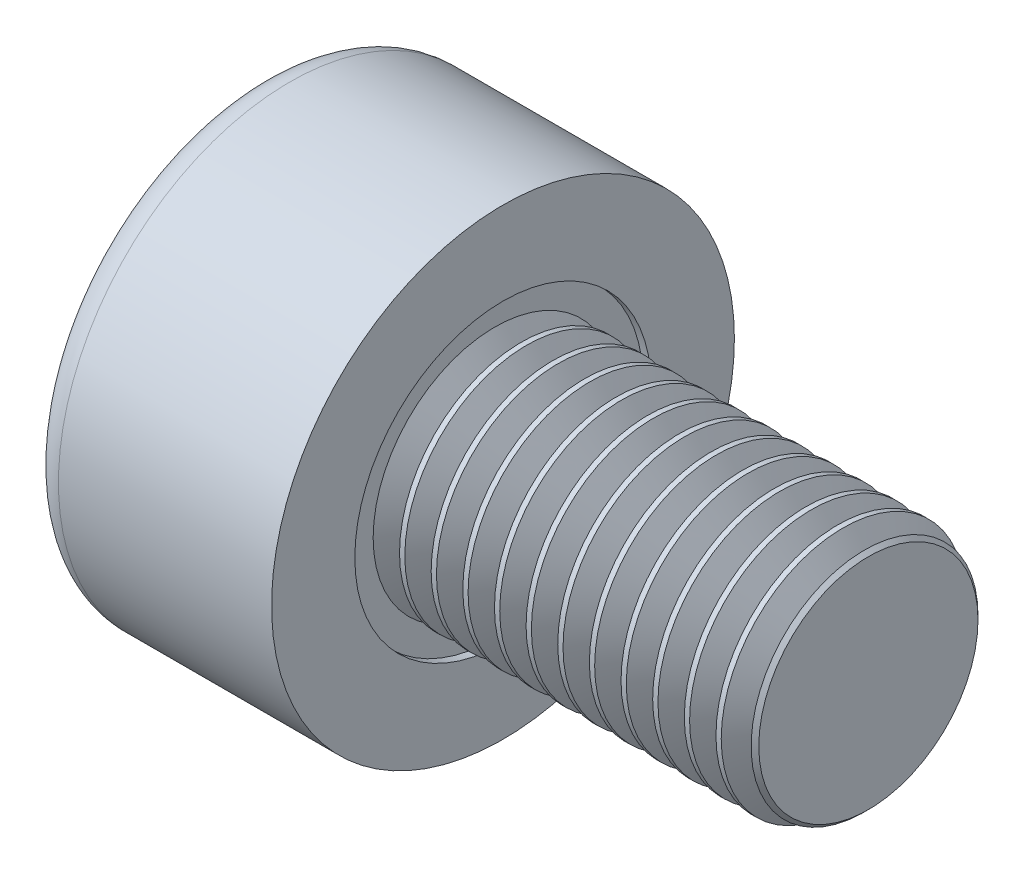
ISO-10303-21;
HEADER;
FILE_DESCRIPTION(('STEP AP214'),'2;1');
FILE_NAME('part.step','',(''),(''),'','','');
FILE_SCHEMA(('AUTOMOTIVE_DESIGN { 1 0 10303 214 1 1 1 1 }'));
ENDSEC;
DATA;
#1=APPLICATION_CONTEXT('core data for automotive mechanical design processes');
#2=APPLICATION_PROTOCOL_DEFINITION('international standard','automotive_design',2000,#1);
#3=PRODUCT_CONTEXT('',#1,'mechanical');
#4=PRODUCT('Part','Part','',(#3));
#5=PRODUCT_RELATED_PRODUCT_CATEGORY('part','',(#4));
#6=PRODUCT_DEFINITION_FORMATION('','',#4);
#7=PRODUCT_DEFINITION_CONTEXT('part definition',#1,'design');
#8=PRODUCT_DEFINITION('design','',#6,#7);
#9=PRODUCT_DEFINITION_SHAPE('','',#8);
#10=(LENGTH_UNIT() NAMED_UNIT(*) SI_UNIT(.MILLI.,.METRE.));
#11=(NAMED_UNIT(*) PLANE_ANGLE_UNIT() SI_UNIT($,.RADIAN.));
#12=(NAMED_UNIT(*) SI_UNIT($,.STERADIAN.) SOLID_ANGLE_UNIT());
#13=UNCERTAINTY_MEASURE_WITH_UNIT(LENGTH_MEASURE(1.E-05),#10,'distance_accuracy_value','');
#14=(GEOMETRIC_REPRESENTATION_CONTEXT(3) GLOBAL_UNCERTAINTY_ASSIGNED_CONTEXT((#13)) GLOBAL_UNIT_ASSIGNED_CONTEXT((#10,
#11,#12)) REPRESENTATION_CONTEXT('',''));
#15=CARTESIAN_POINT('',(0.,0.,0.));
#16=DIRECTION('',(0.,0.,1.));
#17=DIRECTION('',(1.,0.,0.));
#18=AXIS2_PLACEMENT_3D('',#15,#16,#17);
#19=CARTESIAN_POINT('',(5.,0.,0.));
#20=DIRECTION('',(-1.,0.,0.));
#21=DIRECTION('',(0.,0.,1.));
#22=AXIS2_PLACEMENT_3D('',#19,#20,#21);
#23=CYLINDRICAL_SURFACE('',#22,1.);
#24=CARTESIAN_POINT('',(2.19375,0.,0.));
#25=DIRECTION('',(-1.,0.,0.));
#26=DIRECTION('',(0.,0.,1.));
#27=AXIS2_PLACEMENT_3D('',#24,#25,#26);
#28=CIRCLE('',#27,1.);
#29=CARTESIAN_POINT('',(2.19375,0.,1.));
#30=VERTEX_POINT('',#29);
#31=EDGE_CURVE('E298',#30,#30,#28,.T.);
#32=ORIENTED_EDGE('',*,*,#31,.T.);
#33=EDGE_LOOP('',(#32));
#34=FACE_BOUND('',#33,.T.);
#35=CARTESIAN_POINT('',(2.15045,0.,0.));
#36=DIRECTION('',(-1.,0.,0.));
#37=DIRECTION('',(0.,0.,1.));
#38=AXIS2_PLACEMENT_3D('',#35,#36,#37);
#39=CIRCLE('',#38,1.);
#40=CARTESIAN_POINT('',(2.15045,0.,1.));
#41=VERTEX_POINT('',#40);
#42=EDGE_CURVE('E313',#41,#41,#39,.T.);
#43=ORIENTED_EDGE('',*,*,#42,.F.);
#44=EDGE_LOOP('',(#43));
#45=FACE_BOUND('',#44,.T.);
#46=ADVANCED_FACE('F38',(#34,#45),#23,.T.);
#47=CARTESIAN_POINT('',(2.45355,0.,0.));
#48=DIRECTION('',(-1.,0.,0.));
#49=DIRECTION('',(0.,0.,1.));
#50=AXIS2_PLACEMENT_3D('',#47,#48,#49);
#51=CIRCLE('',#50,1.);
#52=CARTESIAN_POINT('',(2.45355,0.,1.));
#53=VERTEX_POINT('',#52);
#54=EDGE_CURVE('E289',#53,#53,#51,.T.);
#55=ORIENTED_EDGE('',*,*,#54,.T.);
#56=EDGE_LOOP('',(#55));
#57=FACE_BOUND('',#56,.T.);
#58=CARTESIAN_POINT('',(2.41025,0.,0.));
#59=DIRECTION('',(-1.,0.,0.));
#60=DIRECTION('',(0.,0.,1.));
#61=AXIS2_PLACEMENT_3D('',#58,#59,#60);
#62=CIRCLE('',#61,1.);
#63=CARTESIAN_POINT('',(2.41025,0.,1.));
#64=VERTEX_POINT('',#63);
#65=EDGE_CURVE('E301',#64,#64,#62,.T.);
#66=ORIENTED_EDGE('',*,*,#65,.F.);
#67=EDGE_LOOP('',(#66));
#68=FACE_BOUND('',#67,.T.);
#69=ADVANCED_FACE('F334',(#57,#68),#23,.T.);
#70=CARTESIAN_POINT('',(2.71335,0.,0.));
#71=DIRECTION('',(-1.,0.,0.));
#72=DIRECTION('',(0.,0.,1.));
#73=AXIS2_PLACEMENT_3D('',#70,#71,#72);
#74=CIRCLE('',#73,1.);
#75=CARTESIAN_POINT('',(2.71335,0.,1.));
#76=VERTEX_POINT('',#75);
#77=EDGE_CURVE('E280',#76,#76,#74,.T.);
#78=ORIENTED_EDGE('',*,*,#77,.T.);
#79=EDGE_LOOP('',(#78));
#80=FACE_BOUND('',#79,.T.);
#81=CARTESIAN_POINT('',(2.67005,0.,0.));
#82=DIRECTION('',(-1.,0.,0.));
#83=DIRECTION('',(0.,0.,1.));
#84=AXIS2_PLACEMENT_3D('',#81,#82,#83);
#85=CIRCLE('',#84,1.);
#86=CARTESIAN_POINT('',(2.67005,0.,1.));
#87=VERTEX_POINT('',#86);
#88=EDGE_CURVE('E292',#87,#87,#85,.T.);
#89=ORIENTED_EDGE('',*,*,#88,.F.);
#90=EDGE_LOOP('',(#89));
#91=FACE_BOUND('',#90,.T.);
#92=ADVANCED_FACE('F341',(#80,#91),#23,.T.);
#93=CARTESIAN_POINT('',(2.97315,0.,0.));
#94=DIRECTION('',(-1.,0.,0.));
#95=DIRECTION('',(0.,0.,1.));
#96=AXIS2_PLACEMENT_3D('',#93,#94,#95);
#97=CIRCLE('',#96,1.);
#98=CARTESIAN_POINT('',(2.97315,0.,1.));
#99=VERTEX_POINT('',#98);
#100=EDGE_CURVE('E271',#99,#99,#97,.T.);
#101=ORIENTED_EDGE('',*,*,#100,.T.);
#102=EDGE_LOOP('',(#101));
#103=FACE_BOUND('',#102,.T.);
#104=CARTESIAN_POINT('',(2.92985,0.,0.));
#105=DIRECTION('',(-1.,0.,0.));
#106=DIRECTION('',(0.,0.,1.));
#107=AXIS2_PLACEMENT_3D('',#104,#105,#106);
#108=CIRCLE('',#107,1.);
#109=CARTESIAN_POINT('',(2.92985,0.,1.));
#110=VERTEX_POINT('',#109);
#111=EDGE_CURVE('E283',#110,#110,#108,.T.);
#112=ORIENTED_EDGE('',*,*,#111,.F.);
#113=EDGE_LOOP('',(#112));
#114=FACE_BOUND('',#113,.T.);
#115=ADVANCED_FACE('F450',(#103,#114),#23,.T.);
#116=CARTESIAN_POINT('',(3.23295,0.,0.));
#117=DIRECTION('',(-1.,0.,0.));
#118=DIRECTION('',(0.,0.,1.));
#119=AXIS2_PLACEMENT_3D('',#116,#117,#118);
#120=CIRCLE('',#119,1.);
#121=CARTESIAN_POINT('',(3.23295,0.,1.));
#122=VERTEX_POINT('',#121);
#123=EDGE_CURVE('E262',#122,#122,#120,.T.);
#124=ORIENTED_EDGE('',*,*,#123,.T.);
#125=EDGE_LOOP('',(#124));
#126=FACE_BOUND('',#125,.T.);
#127=CARTESIAN_POINT('',(3.18965,0.,0.));
#128=DIRECTION('',(-1.,0.,0.));
#129=DIRECTION('',(0.,0.,1.));
#130=AXIS2_PLACEMENT_3D('',#127,#128,#129);
#131=CIRCLE('',#130,1.);
#132=CARTESIAN_POINT('',(3.18965,0.,1.));
#133=VERTEX_POINT('',#132);
#134=EDGE_CURVE('E274',#133,#133,#131,.T.);
#135=ORIENTED_EDGE('',*,*,#134,.F.);
#136=EDGE_LOOP('',(#135));
#137=FACE_BOUND('',#136,.T.);
#138=ADVANCED_FACE('F433',(#126,#137),#23,.T.);
#139=CARTESIAN_POINT('',(3.49275,0.,0.));
#140=DIRECTION('',(-1.,0.,0.));
#141=DIRECTION('',(0.,0.,1.));
#142=AXIS2_PLACEMENT_3D('',#139,#140,#141);
#143=CIRCLE('',#142,1.);
#144=CARTESIAN_POINT('',(3.49275,0.,1.));
#145=VERTEX_POINT('',#144);
#146=EDGE_CURVE('E253',#145,#145,#143,.T.);
#147=ORIENTED_EDGE('',*,*,#146,.T.);
#148=EDGE_LOOP('',(#147));
#149=FACE_BOUND('',#148,.T.);
#150=CARTESIAN_POINT('',(3.44945,0.,0.));
#151=DIRECTION('',(-1.,0.,0.));
#152=DIRECTION('',(0.,0.,1.));
#153=AXIS2_PLACEMENT_3D('',#150,#151,#152);
#154=CIRCLE('',#153,1.);
#155=CARTESIAN_POINT('',(3.44945,0.,1.));
#156=VERTEX_POINT('',#155);
#157=EDGE_CURVE('E265',#156,#156,#154,.T.);
#158=ORIENTED_EDGE('',*,*,#157,.F.);
#159=EDGE_LOOP('',(#158));
#160=FACE_BOUND('',#159,.T.);
#161=ADVANCED_FACE('F416',(#149,#160),#23,.T.);
#162=CARTESIAN_POINT('',(3.75255,0.,0.));
#163=DIRECTION('',(-1.,0.,0.));
#164=DIRECTION('',(0.,0.,1.));
#165=AXIS2_PLACEMENT_3D('',#162,#163,#164);
#166=CIRCLE('',#165,1.);
#167=CARTESIAN_POINT('',(3.75255,0.,1.));
#168=VERTEX_POINT('',#167);
#169=EDGE_CURVE('E244',#168,#168,#166,.T.);
#170=ORIENTED_EDGE('',*,*,#169,.T.);
#171=EDGE_LOOP('',(#170));
#172=FACE_BOUND('',#171,.T.);
#173=CARTESIAN_POINT('',(3.70925,0.,0.));
#174=DIRECTION('',(-1.,0.,0.));
#175=DIRECTION('',(0.,0.,1.));
#176=AXIS2_PLACEMENT_3D('',#173,#174,#175);
#177=CIRCLE('',#176,1.);
#178=CARTESIAN_POINT('',(3.70925,0.,1.));
#179=VERTEX_POINT('',#178);
#180=EDGE_CURVE('E256',#179,#179,#177,.T.);
#181=ORIENTED_EDGE('',*,*,#180,.F.);
#182=EDGE_LOOP('',(#181));
#183=FACE_BOUND('',#182,.T.);
#184=ADVANCED_FACE('F386',(#172,#183),#23,.T.);
#185=CARTESIAN_POINT('',(4.01235,0.,0.));
#186=DIRECTION('',(-1.,0.,0.));
#187=DIRECTION('',(0.,0.,1.));
#188=AXIS2_PLACEMENT_3D('',#185,#186,#187);
#189=CIRCLE('',#188,1.);
#190=CARTESIAN_POINT('',(4.01235,0.,1.));
#191=VERTEX_POINT('',#190);
#192=EDGE_CURVE('E235',#191,#191,#189,.T.);
#193=ORIENTED_EDGE('',*,*,#192,.T.);
#194=EDGE_LOOP('',(#193));
#195=FACE_BOUND('',#194,.T.);
#196=CARTESIAN_POINT('',(3.96905,0.,0.));
#197=DIRECTION('',(-1.,0.,0.));
#198=DIRECTION('',(0.,0.,1.));
#199=AXIS2_PLACEMENT_3D('',#196,#197,#198);
#200=CIRCLE('',#199,1.);
#201=CARTESIAN_POINT('',(3.96905,0.,1.));
#202=VERTEX_POINT('',#201);
#203=EDGE_CURVE('E247',#202,#202,#200,.T.);
#204=ORIENTED_EDGE('',*,*,#203,.F.);
#205=EDGE_LOOP('',(#204));
#206=FACE_BOUND('',#205,.T.);
#207=ADVANCED_FACE('F377',(#195,#206),#23,.T.);
#208=CARTESIAN_POINT('',(4.27215,0.,0.));
#209=DIRECTION('',(-1.,0.,0.));
#210=DIRECTION('',(0.,0.,1.));
#211=AXIS2_PLACEMENT_3D('',#208,#209,#210);
#212=CIRCLE('',#211,1.);
#213=CARTESIAN_POINT('',(4.27215,0.,1.));
#214=VERTEX_POINT('',#213);
#215=EDGE_CURVE('E226',#214,#214,#212,.T.);
#216=ORIENTED_EDGE('',*,*,#215,.T.);
#217=EDGE_LOOP('',(#216));
#218=FACE_BOUND('',#217,.T.);
#219=CARTESIAN_POINT('',(4.22885,0.,0.));
#220=DIRECTION('',(-1.,0.,0.));
#221=DIRECTION('',(0.,0.,1.));
#222=AXIS2_PLACEMENT_3D('',#219,#220,#221);
#223=CIRCLE('',#222,1.);
#224=CARTESIAN_POINT('',(4.22885,0.,1.));
#225=VERTEX_POINT('',#224);
#226=EDGE_CURVE('E238',#225,#225,#223,.T.);
#227=ORIENTED_EDGE('',*,*,#226,.F.);
#228=EDGE_LOOP('',(#227));
#229=FACE_BOUND('',#228,.T.);
#230=ADVANCED_FACE('F364',(#218,#229),#23,.T.);
#231=CARTESIAN_POINT('',(4.27215,0.,0.));
#232=DIRECTION('',(-1.,0.,0.));
#233=DIRECTION('',(0.,0.,1.));
#234=AXIS2_PLACEMENT_3D('',#231,#232,#233);
#235=CONICAL_SURFACE('',#234,1.,1.04719755119661);
#236=CARTESIAN_POINT('',(4.3804,0.,0.));
#237=DIRECTION('',(-1.,0.,0.));
#238=DIRECTION('',(0.,0.,1.));
#239=AXIS2_PLACEMENT_3D('',#236,#237,#238);
#240=CIRCLE('',#239,0.812505500080668);
#241=CARTESIAN_POINT('',(4.3804,0.,0.812505500080668));
#242=VERTEX_POINT('',#241);
#243=EDGE_CURVE('E232',#242,#242,#240,.T.);
#244=ORIENTED_EDGE('',*,*,#243,.T.);
#245=EDGE_LOOP('',(#244));
#246=FACE_BOUND('',#245,.T.);
#247=ORIENTED_EDGE('',*,*,#215,.F.);
#248=EDGE_LOOP('',(#247));
#249=FACE_BOUND('',#248,.T.);
#250=ADVANCED_FACE('F376',(#246,#249),#235,.T.);
#251=CARTESIAN_POINT('',(4.3804,0.,0.));
#252=DIRECTION('',(1.,0.,0.));
#253=DIRECTION('',(0.,0.,-1.));
#254=AXIS2_PLACEMENT_3D('',#251,#252,#253);
#255=CONICAL_SURFACE('',#254,0.812505500080668,1.04719755119658);
#256=CARTESIAN_POINT('',(4.48865,0.,0.));
#257=DIRECTION('',(-1.,0.,0.));
#258=DIRECTION('',(0.,0.,1.));
#259=AXIS2_PLACEMENT_3D('',#256,#257,#258);
#260=CIRCLE('',#259,1.);
#261=CARTESIAN_POINT('',(4.48865,0.,1.));
#262=VERTEX_POINT('',#261);
#263=EDGE_CURVE('E229',#262,#262,#260,.T.);
#264=ORIENTED_EDGE('',*,*,#263,.T.);
#265=EDGE_LOOP('',(#264));
#266=FACE_BOUND('',#265,.T.);
#267=ORIENTED_EDGE('',*,*,#243,.F.);
#268=EDGE_LOOP('',(#267));
#269=FACE_BOUND('',#268,.T.);
#270=ADVANCED_FACE('F383',(#266,#269),#255,.T.);
#271=CARTESIAN_POINT('',(5.,0.,0.));
#272=DIRECTION('',(1.,0.,0.));
#273=DIRECTION('',(0.,0.,-1.));
#274=AXIS2_PLACEMENT_3D('',#271,#272,#273);
#275=PLANE('',#274);
#276=CARTESIAN_POINT('',(5.,0.,0.));
#277=DIRECTION('',(1.,0.,0.));
#278=DIRECTION('',(0.,0.,-1.));
#279=AXIS2_PLACEMENT_3D('',#276,#277,#278);
#280=CIRCLE('',#279,0.899999999999999);
#281=CARTESIAN_POINT('',(5.,0.,-0.899999999999999));
#282=VERTEX_POINT('',#281);
#283=EDGE_CURVE('E12',#282,#282,#280,.T.);
#284=ORIENTED_EDGE('',*,*,#283,.T.);
#285=EDGE_LOOP('',(#284));
#286=FACE_BOUND('',#285,.T.);
#287=ADVANCED_FACE('F514',(#286),#275,.T.);
#288=CARTESIAN_POINT('',(5.,0.,0.));
#289=DIRECTION('',(-1.,0.,0.));
#290=DIRECTION('',(0.,0.,1.));
#291=AXIS2_PLACEMENT_3D('',#288,#289,#290);
#292=CONICAL_SURFACE('',#291,0.899999999999999,0.785398163397444);
#293=ORIENTED_EDGE('',*,*,#283,.F.);
#294=EDGE_LOOP('',(#293));
#295=FACE_BOUND('',#294,.T.);
#296=CARTESIAN_POINT('',(4.96862775004033,0.,0.));
#297=DIRECTION('',(1.,0.,0.));
#298=DIRECTION('',(0.,0.,-1.));
#299=AXIS2_PLACEMENT_3D('',#296,#297,#298);
#300=CIRCLE('',#299,0.931372249959664);
#301=CARTESIAN_POINT('',(4.96862775004033,0.,-0.931372249959664));
#302=VERTEX_POINT('',#301);
#303=EDGE_CURVE('E130',#302,#302,#300,.T.);
#304=ORIENTED_EDGE('',*,*,#303,.T.);
#305=EDGE_LOOP('',(#304));
#306=FACE_BOUND('',#305,.T.);
#307=ADVANCED_FACE('F40',(#295,#306),#292,.T.);
#308=CARTESIAN_POINT('',(4.9,0.,0.));
#309=DIRECTION('',(1.,0.,0.));
#310=DIRECTION('',(0.,0.,-1.));
#311=AXIS2_PLACEMENT_3D('',#308,#309,#310);
#312=CONICAL_SURFACE('',#311,0.812505500080668,1.04719755119658);
#313=ORIENTED_EDGE('',*,*,#303,.F.);
#314=EDGE_LOOP('',(#313));
#315=FACE_BOUND('',#314,.T.);
#316=CARTESIAN_POINT('',(4.9,0.,0.));
#317=DIRECTION('',(-1.,0.,0.));
#318=DIRECTION('',(0.,0.,1.));
#319=AXIS2_PLACEMENT_3D('',#316,#317,#318);
#320=CIRCLE('',#319,0.812505500080668);
#321=CARTESIAN_POINT('',(4.9,0.,0.812505500080668));
#322=VERTEX_POINT('',#321);
#323=EDGE_CURVE('E210',#322,#322,#320,.T.);
#324=ORIENTED_EDGE('',*,*,#323,.F.);
#325=EDGE_LOOP('',(#324));
#326=FACE_BOUND('',#325,.T.);
#327=ADVANCED_FACE('F357',(#315,#326),#312,.T.);
#328=CARTESIAN_POINT('',(4.79175,0.,0.));
#329=DIRECTION('',(-1.,0.,0.));
#330=DIRECTION('',(0.,0.,1.));
#331=AXIS2_PLACEMENT_3D('',#328,#329,#330);
#332=CONICAL_SURFACE('',#331,1.,1.04719755119661);
#333=ORIENTED_EDGE('',*,*,#323,.T.);
#334=EDGE_LOOP('',(#333));
#335=FACE_BOUND('',#334,.T.);
#336=CARTESIAN_POINT('',(4.79175,0.,0.));
#337=DIRECTION('',(-1.,0.,0.));
#338=DIRECTION('',(0.,0.,1.));
#339=AXIS2_PLACEMENT_3D('',#336,#337,#338);
#340=CIRCLE('',#339,1.);
#341=CARTESIAN_POINT('',(4.79175,0.,1.));
#342=VERTEX_POINT('',#341);
#343=EDGE_CURVE('E206',#342,#342,#340,.T.);
#344=ORIENTED_EDGE('',*,*,#343,.F.);
#345=EDGE_LOOP('',(#344));
#346=FACE_BOUND('',#345,.T.);
#347=ADVANCED_FACE('F348',(#335,#346),#332,.T.);
#348=ORIENTED_EDGE('',*,*,#343,.T.);
#349=EDGE_LOOP('',(#348));
#350=FACE_BOUND('',#349,.T.);
#351=CARTESIAN_POINT('',(4.74845,0.,0.));
#352=DIRECTION('',(-1.,0.,0.));
#353=DIRECTION('',(0.,0.,1.));
#354=AXIS2_PLACEMENT_3D('',#351,#352,#353);
#355=CIRCLE('',#354,1.);
#356=CARTESIAN_POINT('',(4.74845,0.,1.));
#357=VERTEX_POINT('',#356);
#358=EDGE_CURVE('E220',#357,#357,#355,.T.);
#359=ORIENTED_EDGE('',*,*,#358,.F.);
#360=EDGE_LOOP('',(#359));
#361=FACE_BOUND('',#360,.T.);
#362=ADVANCED_FACE('F337',(#350,#361),#23,.T.);
#363=CARTESIAN_POINT('',(4.6402,0.,0.));
#364=DIRECTION('',(1.,0.,0.));
#365=DIRECTION('',(0.,0.,-1.));
#366=AXIS2_PLACEMENT_3D('',#363,#364,#365);
#367=CONICAL_SURFACE('',#366,0.812505500080668,1.04719755119658);
#368=ORIENTED_EDGE('',*,*,#358,.T.);
#369=EDGE_LOOP('',(#368));
#370=FACE_BOUND('',#369,.T.);
#371=CARTESIAN_POINT('',(4.6402,0.,0.));
#372=DIRECTION('',(-1.,0.,0.));
#373=DIRECTION('',(0.,0.,1.));
#374=AXIS2_PLACEMENT_3D('',#371,#372,#373);
#375=CIRCLE('',#374,0.812505500080668);
#376=CARTESIAN_POINT('',(4.6402,0.,0.812505500080668));
#377=VERTEX_POINT('',#376);
#378=EDGE_CURVE('E223',#377,#377,#375,.T.);
#379=ORIENTED_EDGE('',*,*,#378,.F.);
#380=EDGE_LOOP('',(#379));
#381=FACE_BOUND('',#380,.T.);
#382=ADVANCED_FACE('F347',(#370,#381),#367,.T.);
#383=CARTESIAN_POINT('',(4.53195,0.,0.));
#384=DIRECTION('',(-1.,0.,0.));
#385=DIRECTION('',(0.,0.,1.));
#386=AXIS2_PLACEMENT_3D('',#383,#384,#385);
#387=CONICAL_SURFACE('',#386,1.,1.04719755119661);
#388=ORIENTED_EDGE('',*,*,#378,.T.);
#389=EDGE_LOOP('',(#388));
#390=FACE_BOUND('',#389,.T.);
#391=CARTESIAN_POINT('',(4.53195,0.,0.));
#392=DIRECTION('',(-1.,0.,0.));
#393=DIRECTION('',(0.,0.,1.));
#394=AXIS2_PLACEMENT_3D('',#391,#392,#393);
#395=CIRCLE('',#394,1.);
#396=CARTESIAN_POINT('',(4.53195,0.,1.));
#397=VERTEX_POINT('',#396);
#398=EDGE_CURVE('E215',#397,#397,#395,.T.);
#399=ORIENTED_EDGE('',*,*,#398,.F.);
#400=EDGE_LOOP('',(#399));
#401=FACE_BOUND('',#400,.T.);
#402=ADVANCED_FACE('F354',(#390,#401),#387,.T.);
#403=ORIENTED_EDGE('',*,*,#398,.T.);
#404=EDGE_LOOP('',(#403));
#405=FACE_BOUND('',#404,.T.);
#406=ORIENTED_EDGE('',*,*,#263,.F.);
#407=EDGE_LOOP('',(#406));
#408=FACE_BOUND('',#407,.T.);
#409=ADVANCED_FACE('F349',(#405,#408),#23,.T.);
#410=CARTESIAN_POINT('',(4.01235,0.,0.));
#411=DIRECTION('',(-1.,0.,0.));
#412=DIRECTION('',(0.,0.,1.));
#413=AXIS2_PLACEMENT_3D('',#410,#411,#412);
#414=CONICAL_SURFACE('',#413,1.,1.04719755119661);
#415=CARTESIAN_POINT('',(4.1206,0.,0.));
#416=DIRECTION('',(-1.,0.,0.));
#417=DIRECTION('',(0.,0.,1.));
#418=AXIS2_PLACEMENT_3D('',#415,#416,#417);
#419=CIRCLE('',#418,0.812505500080668);
#420=CARTESIAN_POINT('',(4.1206,0.,0.812505500080668));
#421=VERTEX_POINT('',#420);
#422=EDGE_CURVE('E241',#421,#421,#419,.T.);
#423=ORIENTED_EDGE('',*,*,#422,.T.);
#424=EDGE_LOOP('',(#423));
#425=FACE_BOUND('',#424,.T.);
#426=ORIENTED_EDGE('',*,*,#192,.F.);
#427=EDGE_LOOP('',(#426));
#428=FACE_BOUND('',#427,.T.);
#429=ADVANCED_FACE('F362',(#425,#428),#414,.T.);
#430=CARTESIAN_POINT('',(4.1206,0.,0.));
#431=DIRECTION('',(1.,0.,0.));
#432=DIRECTION('',(0.,0.,-1.));
#433=AXIS2_PLACEMENT_3D('',#430,#431,#432);
#434=CONICAL_SURFACE('',#433,0.812505500080668,1.04719755119658);
#435=ORIENTED_EDGE('',*,*,#226,.T.);
#436=EDGE_LOOP('',(#435));
#437=FACE_BOUND('',#436,.T.);
#438=ORIENTED_EDGE('',*,*,#422,.F.);
#439=EDGE_LOOP('',(#438));
#440=FACE_BOUND('',#439,.T.);
#441=ADVANCED_FACE('F369',(#437,#440),#434,.T.);
#442=CARTESIAN_POINT('',(3.75255,0.,0.));
#443=DIRECTION('',(-1.,0.,0.));
#444=DIRECTION('',(0.,0.,1.));
#445=AXIS2_PLACEMENT_3D('',#442,#443,#444);
#446=CONICAL_SURFACE('',#445,1.,1.04719755119661);
#447=CARTESIAN_POINT('',(3.8608,0.,0.));
#448=DIRECTION('',(-1.,0.,0.));
#449=DIRECTION('',(0.,0.,1.));
#450=AXIS2_PLACEMENT_3D('',#447,#448,#449);
#451=CIRCLE('',#450,0.812505500080668);
#452=CARTESIAN_POINT('',(3.8608,0.,0.812505500080668));
#453=VERTEX_POINT('',#452);
#454=EDGE_CURVE('E250',#453,#453,#451,.T.);
#455=ORIENTED_EDGE('',*,*,#454,.T.);
#456=EDGE_LOOP('',(#455));
#457=FACE_BOUND('',#456,.T.);
#458=ORIENTED_EDGE('',*,*,#169,.F.);
#459=EDGE_LOOP('',(#458));
#460=FACE_BOUND('',#459,.T.);
#461=ADVANCED_FACE('F394',(#457,#460),#446,.T.);
#462=CARTESIAN_POINT('',(3.8608,0.,0.));
#463=DIRECTION('',(1.,0.,0.));
#464=DIRECTION('',(0.,0.,-1.));
#465=AXIS2_PLACEMENT_3D('',#462,#463,#464);
#466=CONICAL_SURFACE('',#465,0.812505500080668,1.04719755119658);
#467=ORIENTED_EDGE('',*,*,#203,.T.);
#468=EDGE_LOOP('',(#467));
#469=FACE_BOUND('',#468,.T.);
#470=ORIENTED_EDGE('',*,*,#454,.F.);
#471=EDGE_LOOP('',(#470));
#472=FACE_BOUND('',#471,.T.);
#473=ADVANCED_FACE('F402',(#469,#472),#466,.T.);
#474=CARTESIAN_POINT('',(3.49275,0.,0.));
#475=DIRECTION('',(-1.,0.,0.));
#476=DIRECTION('',(0.,0.,1.));
#477=AXIS2_PLACEMENT_3D('',#474,#475,#476);
#478=CONICAL_SURFACE('',#477,1.,1.04719755119661);
#479=CARTESIAN_POINT('',(3.601,0.,0.));
#480=DIRECTION('',(-1.,0.,0.));
#481=DIRECTION('',(0.,0.,1.));
#482=AXIS2_PLACEMENT_3D('',#479,#480,#481);
#483=CIRCLE('',#482,0.812505500080668);
#484=CARTESIAN_POINT('',(3.601,0.,0.812505500080668));
#485=VERTEX_POINT('',#484);
#486=EDGE_CURVE('E259',#485,#485,#483,.T.);
#487=ORIENTED_EDGE('',*,*,#486,.T.);
#488=EDGE_LOOP('',(#487));
#489=FACE_BOUND('',#488,.T.);
#490=ORIENTED_EDGE('',*,*,#146,.F.);
#491=EDGE_LOOP('',(#490));
#492=FACE_BOUND('',#491,.T.);
#493=ADVANCED_FACE('F405',(#489,#492),#478,.T.);
#494=CARTESIAN_POINT('',(3.601,0.,0.));
#495=DIRECTION('',(1.,0.,0.));
#496=DIRECTION('',(0.,0.,-1.));
#497=AXIS2_PLACEMENT_3D('',#494,#495,#496);
#498=CONICAL_SURFACE('',#497,0.812505500080668,1.04719755119658);
#499=ORIENTED_EDGE('',*,*,#180,.T.);
#500=EDGE_LOOP('',(#499));
#501=FACE_BOUND('',#500,.T.);
#502=ORIENTED_EDGE('',*,*,#486,.F.);
#503=EDGE_LOOP('',(#502));
#504=FACE_BOUND('',#503,.T.);
#505=ADVANCED_FACE('F419',(#501,#504),#498,.T.);
#506=CARTESIAN_POINT('',(3.23295,0.,0.));
#507=DIRECTION('',(-1.,0.,0.));
#508=DIRECTION('',(0.,0.,1.));
#509=AXIS2_PLACEMENT_3D('',#506,#507,#508);
#510=CONICAL_SURFACE('',#509,1.,1.04719755119661);
#511=CARTESIAN_POINT('',(3.3412,0.,0.));
#512=DIRECTION('',(-1.,0.,0.));
#513=DIRECTION('',(0.,0.,1.));
#514=AXIS2_PLACEMENT_3D('',#511,#512,#513);
#515=CIRCLE('',#514,0.812505500080668);
#516=CARTESIAN_POINT('',(3.3412,0.,0.812505500080668));
#517=VERTEX_POINT('',#516);
#518=EDGE_CURVE('E268',#517,#517,#515,.T.);
#519=ORIENTED_EDGE('',*,*,#518,.T.);
#520=EDGE_LOOP('',(#519));
#521=FACE_BOUND('',#520,.T.);
#522=ORIENTED_EDGE('',*,*,#123,.F.);
#523=EDGE_LOOP('',(#522));
#524=FACE_BOUND('',#523,.T.);
#525=ADVANCED_FACE('F422',(#521,#524),#510,.T.);
#526=CARTESIAN_POINT('',(3.3412,0.,0.));
#527=DIRECTION('',(1.,0.,0.));
#528=DIRECTION('',(0.,0.,-1.));
#529=AXIS2_PLACEMENT_3D('',#526,#527,#528);
#530=CONICAL_SURFACE('',#529,0.812505500080668,1.04719755119658);
#531=ORIENTED_EDGE('',*,*,#157,.T.);
#532=EDGE_LOOP('',(#531));
#533=FACE_BOUND('',#532,.T.);
#534=ORIENTED_EDGE('',*,*,#518,.F.);
#535=EDGE_LOOP('',(#534));
#536=FACE_BOUND('',#535,.T.);
#537=ADVANCED_FACE('F436',(#533,#536),#530,.T.);
#538=CARTESIAN_POINT('',(2.97315,0.,0.));
#539=DIRECTION('',(-1.,0.,0.));
#540=DIRECTION('',(0.,0.,1.));
#541=AXIS2_PLACEMENT_3D('',#538,#539,#540);
#542=CONICAL_SURFACE('',#541,1.,1.04719755119661);
#543=CARTESIAN_POINT('',(3.0814,0.,0.));
#544=DIRECTION('',(-1.,0.,0.));
#545=DIRECTION('',(0.,0.,1.));
#546=AXIS2_PLACEMENT_3D('',#543,#544,#545);
#547=CIRCLE('',#546,0.812505500080668);
#548=CARTESIAN_POINT('',(3.0814,0.,0.812505500080668));
#549=VERTEX_POINT('',#548);
#550=EDGE_CURVE('E277',#549,#549,#547,.T.);
#551=ORIENTED_EDGE('',*,*,#550,.T.);
#552=EDGE_LOOP('',(#551));
#553=FACE_BOUND('',#552,.T.);
#554=ORIENTED_EDGE('',*,*,#100,.F.);
#555=EDGE_LOOP('',(#554));
#556=FACE_BOUND('',#555,.T.);
#557=ADVANCED_FACE('F439',(#553,#556),#542,.T.);
#558=CARTESIAN_POINT('',(3.0814,0.,0.));
#559=DIRECTION('',(1.,0.,0.));
#560=DIRECTION('',(0.,0.,-1.));
#561=AXIS2_PLACEMENT_3D('',#558,#559,#560);
#562=CONICAL_SURFACE('',#561,0.812505500080668,1.04719755119658);
#563=ORIENTED_EDGE('',*,*,#134,.T.);
#564=EDGE_LOOP('',(#563));
#565=FACE_BOUND('',#564,.T.);
#566=ORIENTED_EDGE('',*,*,#550,.F.);
#567=EDGE_LOOP('',(#566));
#568=FACE_BOUND('',#567,.T.);
#569=ADVANCED_FACE('F453',(#565,#568),#562,.T.);
#570=CARTESIAN_POINT('',(2.71335,0.,0.));
#571=DIRECTION('',(-1.,0.,0.));
#572=DIRECTION('',(0.,0.,1.));
#573=AXIS2_PLACEMENT_3D('',#570,#571,#572);
#574=CONICAL_SURFACE('',#573,1.,1.04719755119661);
#575=CARTESIAN_POINT('',(2.8216,0.,0.));
#576=DIRECTION('',(-1.,0.,0.));
#577=DIRECTION('',(0.,0.,1.));
#578=AXIS2_PLACEMENT_3D('',#575,#576,#577);
#579=CIRCLE('',#578,0.812505500080668);
#580=CARTESIAN_POINT('',(2.8216,0.,0.812505500080668));
#581=VERTEX_POINT('',#580);
#582=EDGE_CURVE('E286',#581,#581,#579,.T.);
#583=ORIENTED_EDGE('',*,*,#582,.T.);
#584=EDGE_LOOP('',(#583));
#585=FACE_BOUND('',#584,.T.);
#586=ORIENTED_EDGE('',*,*,#77,.F.);
#587=EDGE_LOOP('',(#586));
#588=FACE_BOUND('',#587,.T.);
#589=ADVANCED_FACE('F456',(#585,#588),#574,.T.);
#590=CARTESIAN_POINT('',(2.8216,0.,0.));
#591=DIRECTION('',(1.,0.,0.));
#592=DIRECTION('',(0.,0.,-1.));
#593=AXIS2_PLACEMENT_3D('',#590,#591,#592);
#594=CONICAL_SURFACE('',#593,0.812505500080668,1.04719755119658);
#595=ORIENTED_EDGE('',*,*,#111,.T.);
#596=EDGE_LOOP('',(#595));
#597=FACE_BOUND('',#596,.T.);
#598=ORIENTED_EDGE('',*,*,#582,.F.);
#599=EDGE_LOOP('',(#598));
#600=FACE_BOUND('',#599,.T.);
#601=ADVANCED_FACE('F469',(#597,#600),#594,.T.);
#602=CARTESIAN_POINT('',(2.45355,0.,0.));
#603=DIRECTION('',(-1.,0.,0.));
#604=DIRECTION('',(0.,0.,1.));
#605=AXIS2_PLACEMENT_3D('',#602,#603,#604);
#606=CONICAL_SURFACE('',#605,1.,1.04719755119661);
#607=CARTESIAN_POINT('',(2.5618,0.,0.));
#608=DIRECTION('',(-1.,0.,0.));
#609=DIRECTION('',(0.,0.,1.));
#610=AXIS2_PLACEMENT_3D('',#607,#608,#609);
#611=CIRCLE('',#610,0.812505500080668);
#612=CARTESIAN_POINT('',(2.5618,0.,0.812505500080668));
#613=VERTEX_POINT('',#612);
#614=EDGE_CURVE('E295',#613,#613,#611,.T.);
#615=ORIENTED_EDGE('',*,*,#614,.T.);
#616=EDGE_LOOP('',(#615));
#617=FACE_BOUND('',#616,.T.);
#618=ORIENTED_EDGE('',*,*,#54,.F.);
#619=EDGE_LOOP('',(#618));
#620=FACE_BOUND('',#619,.T.);
#621=ADVANCED_FACE('F472',(#617,#620),#606,.T.);
#622=CARTESIAN_POINT('',(2.5618,0.,0.));
#623=DIRECTION('',(1.,0.,0.));
#624=DIRECTION('',(0.,0.,-1.));
#625=AXIS2_PLACEMENT_3D('',#622,#623,#624);
#626=CONICAL_SURFACE('',#625,0.812505500080668,1.04719755119658);
#627=ORIENTED_EDGE('',*,*,#88,.T.);
#628=EDGE_LOOP('',(#627));
#629=FACE_BOUND('',#628,.T.);
#630=ORIENTED_EDGE('',*,*,#614,.F.);
#631=EDGE_LOOP('',(#630));
#632=FACE_BOUND('',#631,.T.);
#633=ADVANCED_FACE('F485',(#629,#632),#626,.T.);
#634=CARTESIAN_POINT('',(2.19375,0.,0.));
#635=DIRECTION('',(-1.,0.,0.));
#636=DIRECTION('',(0.,0.,1.));
#637=AXIS2_PLACEMENT_3D('',#634,#635,#636);
#638=CONICAL_SURFACE('',#637,1.,1.04719755119661);
#639=CARTESIAN_POINT('',(2.302,0.,0.));
#640=DIRECTION('',(-1.,0.,0.));
#641=DIRECTION('',(0.,0.,1.));
#642=AXIS2_PLACEMENT_3D('',#639,#640,#641);
#643=CIRCLE('',#642,0.812505500080668);
#644=CARTESIAN_POINT('',(2.302,0.,0.812505500080668));
#645=VERTEX_POINT('',#644);
#646=EDGE_CURVE('E304',#645,#645,#643,.T.);
#647=ORIENTED_EDGE('',*,*,#646,.T.);
#648=EDGE_LOOP('',(#647));
#649=FACE_BOUND('',#648,.T.);
#650=ORIENTED_EDGE('',*,*,#31,.F.);
#651=EDGE_LOOP('',(#650));
#652=FACE_BOUND('',#651,.T.);
#653=ADVANCED_FACE('F488',(#649,#652),#638,.T.);
#654=CARTESIAN_POINT('',(2.302,0.,0.));
#655=DIRECTION('',(1.,0.,0.));
#656=DIRECTION('',(0.,0.,-1.));
#657=AXIS2_PLACEMENT_3D('',#654,#655,#656);
#658=CONICAL_SURFACE('',#657,0.812505500080668,1.04719755119658);
#659=ORIENTED_EDGE('',*,*,#65,.T.);
#660=EDGE_LOOP('',(#659));
#661=FACE_BOUND('',#660,.T.);
#662=ORIENTED_EDGE('',*,*,#646,.F.);
#663=EDGE_LOOP('',(#662));
#664=FACE_BOUND('',#663,.T.);
#665=ADVANCED_FACE('F499',(#661,#664),#658,.T.);
#666=CARTESIAN_POINT('',(1.93395,0.,0.));
#667=DIRECTION('',(-1.,0.,0.));
#668=DIRECTION('',(0.,0.,1.));
#669=AXIS2_PLACEMENT_3D('',#666,#667,#668);
#670=CONICAL_SURFACE('',#669,1.,1.04719755119661);
#671=CARTESIAN_POINT('',(2.0422,0.,0.));
#672=DIRECTION('',(-1.,0.,0.));
#673=DIRECTION('',(0.,0.,1.));
#674=AXIS2_PLACEMENT_3D('',#671,#672,#673);
#675=CIRCLE('',#674,0.812505500080668);
#676=CARTESIAN_POINT('',(2.0422,0.,0.812505500080668));
#677=VERTEX_POINT('',#676);
#678=EDGE_CURVE('E316',#677,#677,#675,.T.);
#679=ORIENTED_EDGE('',*,*,#678,.T.);
#680=EDGE_LOOP('',(#679));
#681=FACE_BOUND('',#680,.T.);
#682=CARTESIAN_POINT('',(1.93395,0.,0.));
#683=DIRECTION('',(-1.,0.,0.));
#684=DIRECTION('',(0.,0.,1.));
#685=AXIS2_PLACEMENT_3D('',#682,#683,#684);
#686=CIRCLE('',#685,1.);
#687=CARTESIAN_POINT('',(1.93395,0.,1.));
#688=VERTEX_POINT('',#687);
#689=EDGE_CURVE('E307',#688,#688,#686,.T.);
#690=ORIENTED_EDGE('',*,*,#689,.F.);
#691=EDGE_LOOP('',(#690));
#692=FACE_BOUND('',#691,.T.);
#693=ADVANCED_FACE('F320',(#681,#692),#670,.T.);
#694=CARTESIAN_POINT('',(1.93395,1.2165,0.));
#695=DIRECTION('',(1.,0.,0.));
#696=DIRECTION('',(0.,0.,-1.));
#697=AXIS2_PLACEMENT_3D('',#694,#695,#696);
#698=PLANE('',#697);
#699=ORIENTED_EDGE('',*,*,#689,.T.);
#700=EDGE_LOOP('',(#699));
#701=FACE_BOUND('',#700,.T.);
#702=CARTESIAN_POINT('',(1.93395,0.,0.));
#703=DIRECTION('',(-1.,0.,0.));
#704=DIRECTION('',(0.,0.,1.));
#705=AXIS2_PLACEMENT_3D('',#702,#703,#704);
#706=CIRCLE('',#705,1.2165);
#707=CARTESIAN_POINT('',(1.93395,0.,1.2165));
#708=VERTEX_POINT('',#707);
#709=EDGE_CURVE('E310',#708,#708,#706,.T.);
#710=ORIENTED_EDGE('',*,*,#709,.F.);
#711=EDGE_LOOP('',(#710));
#712=FACE_BOUND('',#711,.T.);
#713=ADVANCED_FACE('F330',(#701,#712),#698,.T.);
#714=CARTESIAN_POINT('',(-2.8578,0.,0.));
#715=DIRECTION('',(-1.,0.,0.));
#716=DIRECTION('',(0.,0.,1.));
#717=AXIS2_PLACEMENT_3D('',#714,#715,#716);
#718=CYLINDRICAL_SURFACE('',#717,1.2165);
#719=CARTESIAN_POINT('',(2.,0.,0.));
#720=DIRECTION('',(1.,0.,0.));
#721=DIRECTION('',(0.,0.,-1.));
#722=AXIS2_PLACEMENT_3D('',#719,#720,#721);
#723=CIRCLE('',#722,1.2165);
#724=CARTESIAN_POINT('',(2.,0.,-1.2165));
#725=VERTEX_POINT('',#724);
#726=EDGE_CURVE('E42',#725,#725,#723,.F.);
#727=ORIENTED_EDGE('',*,*,#726,.F.);
#728=EDGE_LOOP('',(#727));
#729=FACE_BOUND('',#728,.T.);
#730=ORIENTED_EDGE('',*,*,#709,.T.);
#731=EDGE_LOOP('',(#730));
#732=FACE_BOUND('',#731,.T.);
#733=ADVANCED_FACE('F324',(#729,#732),#718,.F.);
#734=CARTESIAN_POINT('',(2.0422,0.,0.));
#735=DIRECTION('',(1.,0.,0.));
#736=DIRECTION('',(0.,0.,-1.));
#737=AXIS2_PLACEMENT_3D('',#734,#735,#736);
#738=CONICAL_SURFACE('',#737,0.812505500080668,1.04719755119658);
#739=ORIENTED_EDGE('',*,*,#42,.T.);
#740=EDGE_LOOP('',(#739));
#741=FACE_BOUND('',#740,.T.);
#742=ORIENTED_EDGE('',*,*,#678,.F.);
#743=EDGE_LOOP('',(#742));
#744=FACE_BOUND('',#743,.T.);
#745=ADVANCED_FACE('F117',(#741,#744),#738,.T.);
#746=CARTESIAN_POINT('',(1.,0.,0.));
#747=DIRECTION('',(-1.,0.,0.));
#748=DIRECTION('',(0.,0.,1.));
#749=AXIS2_PLACEMENT_3D('',#746,#747,#748);
#750=CONICAL_SURFACE('',#749,0.75,1.04719755119659);
#751=CARTESIAN_POINT('',(1.43301270189222,0.,0.));
#752=VERTEX_POINT('',#751);
#753=VERTEX_LOOP('',#752);
#754=FACE_BOUND('',#753,.T.);
#755=CARTESIAN_POINT('',(1.,0.,0.));
#756=DIRECTION('',(1.,0.,0.));
#757=DIRECTION('',(0.,0.,-1.));
#758=AXIS2_PLACEMENT_3D('',#755,#756,#757);
#759=CIRCLE('',#758,0.75);
#760=CARTESIAN_POINT('',(1.,0.375,-0.649519052838329));
#761=VERTEX_POINT('',#760);
#762=CARTESIAN_POINT('',(1.,0.75,0.));
#763=VERTEX_POINT('',#762);
#764=EDGE_CURVE('E120',#761,#763,#759,.T.);
#765=ORIENTED_EDGE('',*,*,#764,.F.);
#766=CARTESIAN_POINT('',(1.,0.,0.));
#767=DIRECTION('',(-1.,0.,0.));
#768=DIRECTION('',(0.,0.,1.));
#769=AXIS2_PLACEMENT_3D('',#766,#767,#768);
#770=CIRCLE('',#769,0.75);
#771=CARTESIAN_POINT('',(1.,-0.375,-0.649519052838329));
#772=VERTEX_POINT('',#771);
#773=EDGE_CURVE('E122',#772,#761,#770,.F.);
#774=ORIENTED_EDGE('',*,*,#773,.F.);
#775=CARTESIAN_POINT('',(1.,-0.75,0.));
#776=VERTEX_POINT('',#775);
#777=EDGE_CURVE('E141',#776,#772,#770,.F.);
#778=ORIENTED_EDGE('',*,*,#777,.F.);
#779=CARTESIAN_POINT('',(1.,-0.375,0.649519052838329));
#780=VERTEX_POINT('',#779);
#781=EDGE_CURVE('E55',#780,#776,#770,.F.);
#782=ORIENTED_EDGE('',*,*,#781,.F.);
#783=CARTESIAN_POINT('',(1.,0.375,0.649519052838329));
#784=VERTEX_POINT('',#783);
#785=EDGE_CURVE('E199',#784,#780,#770,.F.);
#786=ORIENTED_EDGE('',*,*,#785,.F.);
#787=EDGE_CURVE('E125',#763,#784,#770,.F.);
#788=ORIENTED_EDGE('',*,*,#787,.F.);
#789=EDGE_LOOP('',(#765,#774,#778,#782,#786,#788));
#790=FACE_BOUND('',#789,.T.);
#791=ADVANCED_FACE('F114',(#754,#790),#750,.F.);
#792=CARTESIAN_POINT('',(1.,-1.5,0.));
#793=DIRECTION('',(-1.,0.,0.));
#794=DIRECTION('',(0.,0.,1.));
#795=AXIS2_PLACEMENT_3D('',#792,#793,#794);
#796=PLANE('',#795);
#797=DIRECTION('',(0.,-0.866025403784438,-0.5));
#798=VECTOR('',#797,1.);
#799=CARTESIAN_POINT('',(1.,0.,0.866025403784439));
#800=LINE('',#799,#798);
#801=CARTESIAN_POINT('',(1.,-0.75,0.433012701892219));
#802=VERTEX_POINT('',#801);
#803=EDGE_CURVE('E161',#780,#802,#800,.T.);
#804=ORIENTED_EDGE('',*,*,#803,.F.);
#805=ORIENTED_EDGE('',*,*,#781,.T.);
#806=DIRECTION('',(0.,0.,-1.));
#807=VECTOR('',#806,1.);
#808=CARTESIAN_POINT('',(1.,-0.75,0.433012701892219));
#809=LINE('',#808,#807);
#810=EDGE_CURVE('E166',#802,#776,#809,.T.);
#811=ORIENTED_EDGE('',*,*,#810,.F.);
#812=EDGE_LOOP('',(#804,#805,#811));
#813=FACE_BOUND('',#812,.T.);
#814=ADVANCED_FACE('F116',(#813),#796,.T.);
#815=DIRECTION('',(0.,-0.866025403784438,0.5));
#816=VECTOR('',#815,1.);
#817=CARTESIAN_POINT('',(1.,0.75,0.43301270189222));
#818=LINE('',#817,#816);
#819=CARTESIAN_POINT('',(1.,0.,0.866025403784439));
#820=VERTEX_POINT('',#819);
#821=EDGE_CURVE('E157',#784,#820,#818,.T.);
#822=ORIENTED_EDGE('',*,*,#821,.F.);
#823=ORIENTED_EDGE('',*,*,#785,.T.);
#824=EDGE_CURVE('E162',#820,#780,#800,.T.);
#825=ORIENTED_EDGE('',*,*,#824,.F.);
#826=EDGE_LOOP('',(#822,#823,#825));
#827=FACE_BOUND('',#826,.T.);
#828=ADVANCED_FACE('F522',(#827),#796,.T.);
#829=DIRECTION('',(0.,0.,1.));
#830=VECTOR('',#829,1.);
#831=CARTESIAN_POINT('',(1.,0.75,-0.433012701892219));
#832=LINE('',#831,#830);
#833=CARTESIAN_POINT('',(1.,0.75,0.43301270189222));
#834=VERTEX_POINT('',#833);
#835=EDGE_CURVE('E153',#763,#834,#832,.T.);
#836=ORIENTED_EDGE('',*,*,#835,.F.);
#837=ORIENTED_EDGE('',*,*,#787,.T.);
#838=EDGE_CURVE('E158',#834,#784,#818,.T.);
#839=ORIENTED_EDGE('',*,*,#838,.F.);
#840=EDGE_LOOP('',(#836,#837,#839));
#841=FACE_BOUND('',#840,.T.);
#842=ADVANCED_FACE('F651',(#841),#796,.T.);
#843=DIRECTION('',(0.,0.866025403784439,0.5));
#844=VECTOR('',#843,1.);
#845=CARTESIAN_POINT('',(1.,0.,-0.866025403784439));
#846=LINE('',#845,#844);
#847=CARTESIAN_POINT('',(1.,0.75,-0.433012701892219));
#848=VERTEX_POINT('',#847);
#849=EDGE_CURVE('E143',#761,#848,#846,.T.);
#850=ORIENTED_EDGE('',*,*,#849,.F.);
#851=ORIENTED_EDGE('',*,*,#764,.T.);
#852=EDGE_CURVE('E146',#848,#763,#832,.T.);
#853=ORIENTED_EDGE('',*,*,#852,.F.);
#854=EDGE_LOOP('',(#850,#851,#853));
#855=FACE_BOUND('',#854,.T.);
#856=ADVANCED_FACE('F144',(#855),#796,.T.);
#857=DIRECTION('',(0.,0.866025403784439,-0.5));
#858=VECTOR('',#857,1.);
#859=CARTESIAN_POINT('',(1.,-0.75,-0.43301270189222));
#860=LINE('',#859,#858);
#861=CARTESIAN_POINT('',(1.,0.,-0.866025403784439));
#862=VERTEX_POINT('',#861);
#863=EDGE_CURVE('E139',#772,#862,#860,.T.);
#864=ORIENTED_EDGE('',*,*,#863,.F.);
#865=ORIENTED_EDGE('',*,*,#773,.T.);
#866=EDGE_CURVE('E137',#862,#761,#846,.T.);
#867=ORIENTED_EDGE('',*,*,#866,.F.);
#868=EDGE_LOOP('',(#864,#865,#867));
#869=FACE_BOUND('',#868,.T.);
#870=ADVANCED_FACE('F135',(#869),#796,.T.);
#871=CARTESIAN_POINT('',(1.,-0.75,-0.43301270189222));
#872=VERTEX_POINT('',#871);
#873=EDGE_CURVE('E165',#776,#872,#809,.T.);
#874=ORIENTED_EDGE('',*,*,#873,.F.);
#875=ORIENTED_EDGE('',*,*,#777,.T.);
#876=EDGE_CURVE('E149',#872,#772,#860,.T.);
#877=ORIENTED_EDGE('',*,*,#876,.F.);
#878=EDGE_LOOP('',(#874,#875,#877));
#879=FACE_BOUND('',#878,.T.);
#880=ADVANCED_FACE('F524',(#879),#796,.T.);
#881=CARTESIAN_POINT('',(1.,-0.75,0.433012701892219));
#882=DIRECTION('',(0.,1.,0.));
#883=DIRECTION('',(0.,0.,1.));
#884=AXIS2_PLACEMENT_3D('',#881,#882,#883);
#885=PLANE('',#884);
#886=DIRECTION('',(0.,0.,-1.));
#887=VECTOR('',#886,1.);
#888=CARTESIAN_POINT('',(0.,-0.75,0.433012701892219));
#889=LINE('',#888,#887);
#890=CARTESIAN_POINT('',(0.,-0.75,0.433012701892219));
#891=VERTEX_POINT('',#890);
#892=CARTESIAN_POINT('',(0.,-0.75,-0.43301270189222));
#893=VERTEX_POINT('',#892);
#894=EDGE_CURVE('E183',#891,#893,#889,.T.);
#895=ORIENTED_EDGE('',*,*,#894,.F.);
#896=DIRECTION('',(-1.,0.,0.));
#897=VECTOR('',#896,1.);
#898=CARTESIAN_POINT('',(1.,-0.75,0.433012701892219));
#899=LINE('',#898,#897);
#900=EDGE_CURVE('E187',#802,#891,#899,.T.);
#901=ORIENTED_EDGE('',*,*,#900,.F.);
#902=ORIENTED_EDGE('',*,*,#810,.T.);
#903=ORIENTED_EDGE('',*,*,#873,.T.);
#904=DIRECTION('',(-1.,0.,0.));
#905=VECTOR('',#904,1.);
#906=CARTESIAN_POINT('',(1.,-0.75,-0.43301270189222));
#907=LINE('',#906,#905);
#908=EDGE_CURVE('E169',#872,#893,#907,.T.);
#909=ORIENTED_EDGE('',*,*,#908,.T.);
#910=EDGE_LOOP('',(#895,#901,#902,#903,#909));
#911=FACE_BOUND('',#910,.T.);
#912=ADVANCED_FACE('F525',(#911),#885,.T.);
#913=CARTESIAN_POINT('',(1.,0.,0.866025403784439));
#914=DIRECTION('',(0.,0.5,-0.866025403784438));
#915=DIRECTION('',(0.,0.866025403784438,0.5));
#916=AXIS2_PLACEMENT_3D('',#913,#914,#915);
#917=PLANE('',#916);
#918=DIRECTION('',(0.,-0.866025403784438,-0.5));
#919=VECTOR('',#918,1.);
#920=CARTESIAN_POINT('',(0.,0.,0.866025403784439));
#921=LINE('',#920,#919);
#922=CARTESIAN_POINT('',(0.,0.,0.866025403784439));
#923=VERTEX_POINT('',#922);
#924=EDGE_CURVE('E180',#923,#891,#921,.T.);
#925=ORIENTED_EDGE('',*,*,#924,.F.);
#926=DIRECTION('',(-1.,0.,0.));
#927=VECTOR('',#926,1.);
#928=CARTESIAN_POINT('',(1.,0.,0.866025403784439));
#929=LINE('',#928,#927);
#930=EDGE_CURVE('E189',#820,#923,#929,.T.);
#931=ORIENTED_EDGE('',*,*,#930,.F.);
#932=ORIENTED_EDGE('',*,*,#824,.T.);
#933=ORIENTED_EDGE('',*,*,#803,.T.);
#934=ORIENTED_EDGE('',*,*,#900,.T.);
#935=EDGE_LOOP('',(#925,#931,#932,#933,#934));
#936=FACE_BOUND('',#935,.T.);
#937=ADVANCED_FACE('F528',(#936),#917,.T.);
#938=CARTESIAN_POINT('',(1.,0.75,0.43301270189222));
#939=DIRECTION('',(0.,-0.5,-0.866025403784438));
#940=DIRECTION('',(0.,0.866025403784439,-0.5));
#941=AXIS2_PLACEMENT_3D('',#938,#939,#940);
#942=PLANE('',#941);
#943=DIRECTION('',(0.,-0.866025403784438,0.5));
#944=VECTOR('',#943,1.);
#945=CARTESIAN_POINT('',(0.,0.75,0.43301270189222));
#946=LINE('',#945,#944);
#947=CARTESIAN_POINT('',(0.,0.75,0.43301270189222));
#948=VERTEX_POINT('',#947);
#949=EDGE_CURVE('E177',#948,#923,#946,.T.);
#950=ORIENTED_EDGE('',*,*,#949,.F.);
#951=DIRECTION('',(-1.,0.,0.));
#952=VECTOR('',#951,1.);
#953=CARTESIAN_POINT('',(1.,0.75,0.43301270189222));
#954=LINE('',#953,#952);
#955=EDGE_CURVE('E191',#834,#948,#954,.T.);
#956=ORIENTED_EDGE('',*,*,#955,.F.);
#957=ORIENTED_EDGE('',*,*,#838,.T.);
#958=ORIENTED_EDGE('',*,*,#821,.T.);
#959=ORIENTED_EDGE('',*,*,#930,.T.);
#960=EDGE_LOOP('',(#950,#956,#957,#958,#959));
#961=FACE_BOUND('',#960,.T.);
#962=ADVANCED_FACE('F532',(#961),#942,.T.);
#963=CARTESIAN_POINT('',(1.,0.75,-0.433012701892219));
#964=DIRECTION('',(0.,-1.,0.));
#965=DIRECTION('',(0.,0.,-1.));
#966=AXIS2_PLACEMENT_3D('',#963,#964,#965);
#967=PLANE('',#966);
#968=DIRECTION('',(0.,0.,1.));
#969=VECTOR('',#968,1.);
#970=CARTESIAN_POINT('',(0.,0.75,-0.433012701892219));
#971=LINE('',#970,#969);
#972=CARTESIAN_POINT('',(0.,0.75,-0.433012701892219));
#973=VERTEX_POINT('',#972);
#974=EDGE_CURVE('E174',#973,#948,#971,.T.);
#975=ORIENTED_EDGE('',*,*,#974,.F.);
#976=DIRECTION('',(-1.,0.,0.));
#977=VECTOR('',#976,1.);
#978=CARTESIAN_POINT('',(1.,0.75,-0.433012701892219));
#979=LINE('',#978,#977);
#980=EDGE_CURVE('E193',#848,#973,#979,.T.);
#981=ORIENTED_EDGE('',*,*,#980,.F.);
#982=ORIENTED_EDGE('',*,*,#852,.T.);
#983=ORIENTED_EDGE('',*,*,#835,.T.);
#984=ORIENTED_EDGE('',*,*,#955,.T.);
#985=EDGE_LOOP('',(#975,#981,#982,#983,#984));
#986=FACE_BOUND('',#985,.T.);
#987=ADVANCED_FACE('F536',(#986),#967,.T.);
#988=CARTESIAN_POINT('',(1.,0.,-0.866025403784439));
#989=DIRECTION('',(0.,-0.5,0.866025403784439));
#990=DIRECTION('',(0.,-0.866025403784439,-0.5));
#991=AXIS2_PLACEMENT_3D('',#988,#989,#990);
#992=PLANE('',#991);
#993=DIRECTION('',(0.,0.866025403784439,0.5));
#994=VECTOR('',#993,1.);
#995=CARTESIAN_POINT('',(0.,0.,-0.866025403784439));
#996=LINE('',#995,#994);
#997=CARTESIAN_POINT('',(0.,0.,-0.866025403784439));
#998=VERTEX_POINT('',#997);
#999=EDGE_CURVE('E171',#998,#973,#996,.T.);
#1000=ORIENTED_EDGE('',*,*,#999,.F.);
#1001=DIRECTION('',(-1.,0.,0.));
#1002=VECTOR('',#1001,1.);
#1003=CARTESIAN_POINT('',(1.,0.,-0.866025403784439));
#1004=LINE('',#1003,#1002);
#1005=EDGE_CURVE('E152',#862,#998,#1004,.T.);
#1006=ORIENTED_EDGE('',*,*,#1005,.F.);
#1007=ORIENTED_EDGE('',*,*,#866,.T.);
#1008=ORIENTED_EDGE('',*,*,#849,.T.);
#1009=ORIENTED_EDGE('',*,*,#980,.T.);
#1010=EDGE_LOOP('',(#1000,#1006,#1007,#1008,#1009));
#1011=FACE_BOUND('',#1010,.T.);
#1012=ADVANCED_FACE('F151',(#1011),#992,.T.);
#1013=CARTESIAN_POINT('',(1.,-0.75,-0.43301270189222));
#1014=DIRECTION('',(0.,0.5,0.866025403784439));
#1015=DIRECTION('',(0.,-0.866025403784439,0.5));
#1016=AXIS2_PLACEMENT_3D('',#1013,#1014,#1015);
#1017=PLANE('',#1016);
#1018=DIRECTION('',(0.,0.866025403784439,-0.5));
#1019=VECTOR('',#1018,1.);
#1020=CARTESIAN_POINT('',(0.,-0.75,-0.43301270189222));
#1021=LINE('',#1020,#1019);
#1022=EDGE_CURVE('E63',#893,#998,#1021,.T.);
#1023=ORIENTED_EDGE('',*,*,#1022,.F.);
#1024=ORIENTED_EDGE('',*,*,#908,.F.);
#1025=ORIENTED_EDGE('',*,*,#876,.T.);
#1026=ORIENTED_EDGE('',*,*,#863,.T.);
#1027=ORIENTED_EDGE('',*,*,#1005,.T.);
#1028=EDGE_LOOP('',(#1023,#1024,#1025,#1026,#1027));
#1029=FACE_BOUND('',#1028,.T.);
#1030=ADVANCED_FACE('F543',(#1029),#1017,.T.);
#1031=CARTESIAN_POINT('',(0.,0.,0.));
#1032=DIRECTION('',(1.,0.,0.));
#1033=DIRECTION('',(0.,0.,-1.));
#1034=AXIS2_PLACEMENT_3D('',#1031,#1032,#1033);
#1035=PLANE('',#1034);
#1036=CARTESIAN_POINT('',(0.,0.,0.));
#1037=DIRECTION('',(1.,0.,0.));
#1038=DIRECTION('',(0.,0.,-1.));
#1039=AXIS2_PLACEMENT_3D('',#1036,#1037,#1038);
#1040=CIRCLE('',#1039,1.65);
#1041=CARTESIAN_POINT('',(0.,0.,-1.65));
#1042=VERTEX_POINT('',#1041);
#1043=EDGE_CURVE('E47',#1042,#1042,#1040,.F.);
#1044=ORIENTED_EDGE('',*,*,#1043,.T.);
#1045=EDGE_LOOP('',(#1044));
#1046=FACE_BOUND('',#1045,.T.);
#1047=ORIENTED_EDGE('',*,*,#1022,.T.);
#1048=ORIENTED_EDGE('',*,*,#999,.T.);
#1049=ORIENTED_EDGE('',*,*,#974,.T.);
#1050=ORIENTED_EDGE('',*,*,#949,.T.);
#1051=ORIENTED_EDGE('',*,*,#924,.T.);
#1052=ORIENTED_EDGE('',*,*,#894,.T.);
#1053=EDGE_LOOP('',(#1047,#1048,#1049,#1050,#1051,#1052));
#1054=FACE_BOUND('',#1053,.T.);
#1055=ADVANCED_FACE('F545',(#1046,#1054),#1035,.F.);
#1056=CARTESIAN_POINT('',(0.25,0.,0.));
#1057=DIRECTION('',(1.,0.,0.));
#1058=DIRECTION('',(0.,0.,-1.));
#1059=AXIS2_PLACEMENT_3D('',#1056,#1057,#1058);
#1060=TOROIDAL_SURFACE('',#1059,1.65,0.25);
#1061=ORIENTED_EDGE('',*,*,#1043,.F.);
#1062=EDGE_LOOP('',(#1061));
#1063=FACE_BOUND('',#1062,.T.);
#1064=CARTESIAN_POINT('',(0.25,0.,0.));
#1065=DIRECTION('',(1.,0.,0.));
#1066=DIRECTION('',(0.,0.,-1.));
#1067=AXIS2_PLACEMENT_3D('',#1064,#1065,#1066);
#1068=CIRCLE('',#1067,1.9);
#1069=CARTESIAN_POINT('',(0.25,0.,-1.9));
#1070=VERTEX_POINT('',#1069);
#1071=EDGE_CURVE('E201',#1070,#1070,#1068,.T.);
#1072=ORIENTED_EDGE('',*,*,#1071,.F.);
#1073=EDGE_LOOP('',(#1072));
#1074=FACE_BOUND('',#1073,.T.);
#1075=ADVANCED_FACE('F575',(#1063,#1074),#1060,.T.);
#1076=CARTESIAN_POINT('',(2.,0.,0.));
#1077=DIRECTION('',(-1.,0.,0.));
#1078=DIRECTION('',(0.,0.,1.));
#1079=AXIS2_PLACEMENT_3D('',#1076,#1077,#1078);
#1080=CYLINDRICAL_SURFACE('',#1079,1.9);
#1081=ORIENTED_EDGE('',*,*,#1071,.T.);
#1082=EDGE_LOOP('',(#1081));
#1083=FACE_BOUND('',#1082,.T.);
#1084=CARTESIAN_POINT('',(2.,0.,0.));
#1085=DIRECTION('',(1.,0.,0.));
#1086=DIRECTION('',(0.,0.,-1.));
#1087=AXIS2_PLACEMENT_3D('',#1084,#1085,#1086);
#1088=CIRCLE('',#1087,1.9);
#1089=CARTESIAN_POINT('',(2.,0.,-1.9));
#1090=VERTEX_POINT('',#1089);
#1091=EDGE_CURVE('E196',#1090,#1090,#1088,.T.);
#1092=ORIENTED_EDGE('',*,*,#1091,.F.);
#1093=EDGE_LOOP('',(#1092));
#1094=FACE_BOUND('',#1093,.T.);
#1095=ADVANCED_FACE('F580',(#1083,#1094),#1080,.T.);
#1096=CARTESIAN_POINT('',(2.,0.,0.));
#1097=DIRECTION('',(1.,0.,0.));
#1098=DIRECTION('',(0.,0.,-1.));
#1099=AXIS2_PLACEMENT_3D('',#1096,#1097,#1098);
#1100=PLANE('',#1099);
#1101=ORIENTED_EDGE('',*,*,#1091,.T.);
#1102=EDGE_LOOP('',(#1101));
#1103=FACE_BOUND('',#1102,.T.);
#1104=ORIENTED_EDGE('',*,*,#726,.T.);
#1105=EDGE_LOOP('',(#1104));
#1106=FACE_BOUND('',#1105,.T.);
#1107=ADVANCED_FACE('F590',(#1103,#1106),#1100,.T.);
#1108=CLOSED_SHELL('',(#46,#69,#92,#115,#138,#161,#184,#207,#230,#250,#270,#287,#307,#327,#347,
#362,#382,#402,#409,#429,#441,#461,#473,#493,#505,#525,#537,#557,#569,#589,#601,#621,#633,#653,
#665,#693,#713,#733,#745,#791,#814,#828,#842,#856,#870,#880,#912,#937,#962,#987,#1012,#1030,
#1055,#1075,#1095,#1107));
#1109=MANIFOLD_SOLID_BREP('B2',#1108);
#1110=ADVANCED_BREP_SHAPE_REPRESENTATION('',(#18,#1109),#14);
#1111=SHAPE_DEFINITION_REPRESENTATION(#9,#1110);
ENDSEC;
END-ISO-10303-21;
